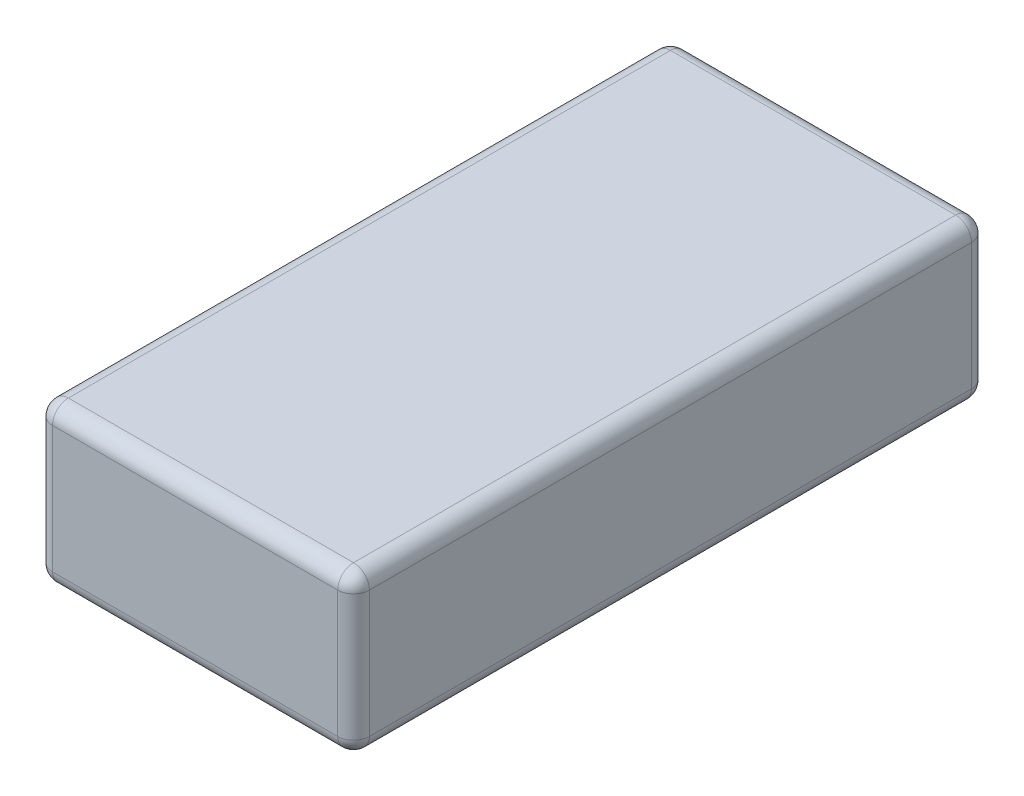
ISO-10303-21;
HEADER;
FILE_DESCRIPTION(('STEP AP214'),'2;1');
FILE_NAME('part.step','',(''),(''),'','','');
FILE_SCHEMA(('AUTOMOTIVE_DESIGN { 1 0 10303 214 1 1 1 1 }'));
ENDSEC;
DATA;
#1=APPLICATION_CONTEXT('core data for automotive mechanical design processes');
#2=APPLICATION_PROTOCOL_DEFINITION('international standard','automotive_design',2000,#1);
#3=PRODUCT_CONTEXT('',#1,'mechanical');
#4=PRODUCT('Part','Part','',(#3));
#5=PRODUCT_RELATED_PRODUCT_CATEGORY('part','',(#4));
#6=PRODUCT_DEFINITION_FORMATION('','',#4);
#7=PRODUCT_DEFINITION_CONTEXT('part definition',#1,'design');
#8=PRODUCT_DEFINITION('design','',#6,#7);
#9=PRODUCT_DEFINITION_SHAPE('','',#8);
#10=(LENGTH_UNIT() NAMED_UNIT(*) SI_UNIT(.MILLI.,.METRE.));
#11=(NAMED_UNIT(*) PLANE_ANGLE_UNIT() SI_UNIT($,.RADIAN.));
#12=(NAMED_UNIT(*) SI_UNIT($,.STERADIAN.) SOLID_ANGLE_UNIT());
#13=UNCERTAINTY_MEASURE_WITH_UNIT(LENGTH_MEASURE(1.E-05),#10,'distance_accuracy_value','');
#14=(GEOMETRIC_REPRESENTATION_CONTEXT(3) GLOBAL_UNCERTAINTY_ASSIGNED_CONTEXT((#13)) GLOBAL_UNIT_ASSIGNED_CONTEXT((#10,
#11,#12)) REPRESENTATION_CONTEXT('',''));
#15=CARTESIAN_POINT('',(0.,0.,0.));
#16=DIRECTION('',(0.,0.,1.));
#17=DIRECTION('',(1.,0.,0.));
#18=AXIS2_PLACEMENT_3D('',#15,#16,#17);
#19=CARTESIAN_POINT('',(-5.,5.,10.));
#20=DIRECTION('',(1.,0.,0.));
#21=DIRECTION('',(0.,0.,-1.));
#22=AXIS2_PLACEMENT_3D('',#19,#20,#21);
#23=PLANE('',#22);
#24=DIRECTION('',(0.,-1.,0.));
#25=VECTOR('',#24,1.);
#26=CARTESIAN_POINT('',(-5.,5.,-9.5));
#27=LINE('',#26,#25);
#28=CARTESIAN_POINT('',(-5.,4.5,-9.5));
#29=VERTEX_POINT('',#28);
#30=CARTESIAN_POINT('',(-5.,0.5,-9.5));
#31=VERTEX_POINT('',#30);
#32=EDGE_CURVE('E135',#29,#31,#27,.T.);
#33=ORIENTED_EDGE('',*,*,#32,.T.);
#34=DIRECTION('',(0.,0.,1.));
#35=VECTOR('',#34,1.);
#36=CARTESIAN_POINT('',(-5.,0.5,10.));
#37=LINE('',#36,#35);
#38=CARTESIAN_POINT('',(-5.,0.5,9.5));
#39=VERTEX_POINT('',#38);
#40=EDGE_CURVE('E131',#31,#39,#37,.T.);
#41=ORIENTED_EDGE('',*,*,#40,.T.);
#42=DIRECTION('',(0.,-1.,0.));
#43=VECTOR('',#42,1.);
#44=CARTESIAN_POINT('',(-5.,5.,9.5));
#45=LINE('',#44,#43);
#46=CARTESIAN_POINT('',(-5.,4.5,9.5));
#47=VERTEX_POINT('',#46);
#48=EDGE_CURVE('E124',#39,#47,#45,.F.);
#49=ORIENTED_EDGE('',*,*,#48,.T.);
#50=DIRECTION('',(0.,0.,1.));
#51=VECTOR('',#50,1.);
#52=CARTESIAN_POINT('',(-5.,4.5,-10.));
#53=LINE('',#52,#51);
#54=EDGE_CURVE('E128',#47,#29,#53,.F.);
#55=ORIENTED_EDGE('',*,*,#54,.T.);
#56=EDGE_LOOP('',(#33,#41,#49,#55));
#57=FACE_BOUND('',#56,.T.);
#58=ADVANCED_FACE('F36',(#57),#23,.F.);
#59=CARTESIAN_POINT('',(5.,5.,10.));
#60=DIRECTION('',(0.,0.,-1.));
#61=DIRECTION('',(-1.,0.,0.));
#62=AXIS2_PLACEMENT_3D('',#59,#60,#61);
#63=PLANE('',#62);
#64=DIRECTION('',(0.,-1.,0.));
#65=VECTOR('',#64,1.);
#66=CARTESIAN_POINT('',(-4.5,5.,10.));
#67=LINE('',#66,#65);
#68=CARTESIAN_POINT('',(-4.5,4.5,10.));
#69=VERTEX_POINT('',#68);
#70=CARTESIAN_POINT('',(-4.5,0.5,10.));
#71=VERTEX_POINT('',#70);
#72=EDGE_CURVE('E143',#69,#71,#67,.T.);
#73=ORIENTED_EDGE('',*,*,#72,.T.);
#74=DIRECTION('',(1.,0.,0.));
#75=VECTOR('',#74,1.);
#76=CARTESIAN_POINT('',(5.,0.5,10.));
#77=LINE('',#76,#75);
#78=CARTESIAN_POINT('',(4.5,0.5,10.));
#79=VERTEX_POINT('',#78);
#80=EDGE_CURVE('E181',#71,#79,#77,.T.);
#81=ORIENTED_EDGE('',*,*,#80,.T.);
#82=DIRECTION('',(0.,-1.,0.));
#83=VECTOR('',#82,1.);
#84=CARTESIAN_POINT('',(4.5,5.,10.));
#85=LINE('',#84,#83);
#86=CARTESIAN_POINT('',(4.5,4.5,10.));
#87=VERTEX_POINT('',#86);
#88=EDGE_CURVE('E178',#79,#87,#85,.F.);
#89=ORIENTED_EDGE('',*,*,#88,.T.);
#90=DIRECTION('',(1.,0.,0.));
#91=VECTOR('',#90,1.);
#92=CARTESIAN_POINT('',(-5.,4.5,10.));
#93=LINE('',#92,#91);
#94=EDGE_CURVE('E176',#87,#69,#93,.F.);
#95=ORIENTED_EDGE('',*,*,#94,.T.);
#96=EDGE_LOOP('',(#73,#81,#89,#95));
#97=FACE_BOUND('',#96,.T.);
#98=ADVANCED_FACE('F298',(#97),#63,.F.);
#99=CARTESIAN_POINT('',(5.,5.,10.));
#100=DIRECTION('',(-1.,0.,0.));
#101=DIRECTION('',(0.,0.,1.));
#102=AXIS2_PLACEMENT_3D('',#99,#100,#101);
#103=PLANE('',#102);
#104=DIRECTION('',(0.,-1.,0.));
#105=VECTOR('',#104,1.);
#106=CARTESIAN_POINT('',(5.,5.,9.5));
#107=LINE('',#106,#105);
#108=CARTESIAN_POINT('',(5.,4.5,9.5));
#109=VERTEX_POINT('',#108);
#110=CARTESIAN_POINT('',(5.,0.5,9.5));
#111=VERTEX_POINT('',#110);
#112=EDGE_CURVE('E187',#109,#111,#107,.T.);
#113=ORIENTED_EDGE('',*,*,#112,.T.);
#114=DIRECTION('',(0.,0.,-1.));
#115=VECTOR('',#114,1.);
#116=CARTESIAN_POINT('',(5.,0.5,10.));
#117=LINE('',#116,#115);
#118=CARTESIAN_POINT('',(5.,0.5,-9.5));
#119=VERTEX_POINT('',#118);
#120=EDGE_CURVE('E190',#111,#119,#117,.T.);
#121=ORIENTED_EDGE('',*,*,#120,.T.);
#122=DIRECTION('',(0.,-1.,0.));
#123=VECTOR('',#122,1.);
#124=CARTESIAN_POINT('',(5.,5.,-9.5));
#125=LINE('',#124,#123);
#126=CARTESIAN_POINT('',(5.,4.5,-9.5));
#127=VERTEX_POINT('',#126);
#128=EDGE_CURVE('E185',#119,#127,#125,.F.);
#129=ORIENTED_EDGE('',*,*,#128,.T.);
#130=DIRECTION('',(0.,0.,-1.));
#131=VECTOR('',#130,1.);
#132=CARTESIAN_POINT('',(5.,4.5,10.));
#133=LINE('',#132,#131);
#134=EDGE_CURVE('E183',#127,#109,#133,.F.);
#135=ORIENTED_EDGE('',*,*,#134,.T.);
#136=EDGE_LOOP('',(#113,#121,#129,#135));
#137=FACE_BOUND('',#136,.T.);
#138=ADVANCED_FACE('F275',(#137),#103,.F.);
#139=CARTESIAN_POINT('',(5.,5.,-10.));
#140=DIRECTION('',(0.,0.,1.));
#141=DIRECTION('',(1.,0.,0.));
#142=AXIS2_PLACEMENT_3D('',#139,#140,#141);
#143=PLANE('',#142);
#144=DIRECTION('',(0.,-1.,0.));
#145=VECTOR('',#144,1.);
#146=CARTESIAN_POINT('',(4.5,5.,-10.));
#147=LINE('',#146,#145);
#148=CARTESIAN_POINT('',(4.5,4.5,-10.));
#149=VERTEX_POINT('',#148);
#150=CARTESIAN_POINT('',(4.5,0.5,-10.));
#151=VERTEX_POINT('',#150);
#152=EDGE_CURVE('E169',#149,#151,#147,.T.);
#153=ORIENTED_EDGE('',*,*,#152,.T.);
#154=DIRECTION('',(-1.,0.,0.));
#155=VECTOR('',#154,1.);
#156=CARTESIAN_POINT('',(5.,0.5,-10.));
#157=LINE('',#156,#155);
#158=CARTESIAN_POINT('',(-4.5,0.5,-10.));
#159=VERTEX_POINT('',#158);
#160=EDGE_CURVE('E174',#151,#159,#157,.T.);
#161=ORIENTED_EDGE('',*,*,#160,.T.);
#162=DIRECTION('',(0.,-1.,0.));
#163=VECTOR('',#162,1.);
#164=CARTESIAN_POINT('',(-4.5,5.,-10.));
#165=LINE('',#164,#163);
#166=CARTESIAN_POINT('',(-4.5,4.5,-10.));
#167=VERTEX_POINT('',#166);
#168=EDGE_CURVE('E171',#159,#167,#165,.F.);
#169=ORIENTED_EDGE('',*,*,#168,.T.);
#170=DIRECTION('',(-1.,0.,0.));
#171=VECTOR('',#170,1.);
#172=CARTESIAN_POINT('',(5.,4.5,-10.));
#173=LINE('',#172,#171);
#174=EDGE_CURVE('E167',#167,#149,#173,.F.);
#175=ORIENTED_EDGE('',*,*,#174,.T.);
#176=EDGE_LOOP('',(#153,#161,#169,#175));
#177=FACE_BOUND('',#176,.T.);
#178=ADVANCED_FACE('F305',(#177),#143,.F.);
#179=CARTESIAN_POINT('',(0.,5.,0.));
#180=DIRECTION('',(0.,1.,0.));
#181=DIRECTION('',(0.,0.,1.));
#182=AXIS2_PLACEMENT_3D('',#179,#180,#181);
#183=PLANE('',#182);
#184=DIRECTION('',(0.,0.,-1.));
#185=VECTOR('',#184,1.);
#186=CARTESIAN_POINT('',(4.5,5.,-10.));
#187=LINE('',#186,#185);
#188=CARTESIAN_POINT('',(4.5,5.,9.5));
#189=VERTEX_POINT('',#188);
#190=CARTESIAN_POINT('',(4.5,5.,-9.5));
#191=VERTEX_POINT('',#190);
#192=EDGE_CURVE('E45',#189,#191,#187,.T.);
#193=ORIENTED_EDGE('',*,*,#192,.T.);
#194=DIRECTION('',(-1.,0.,0.));
#195=VECTOR('',#194,1.);
#196=CARTESIAN_POINT('',(-5.,5.,-9.5));
#197=LINE('',#196,#195);
#198=CARTESIAN_POINT('',(-4.5,5.,-9.5));
#199=VERTEX_POINT('',#198);
#200=EDGE_CURVE('E11',#191,#199,#197,.T.);
#201=ORIENTED_EDGE('',*,*,#200,.T.);
#202=DIRECTION('',(0.,0.,1.));
#203=VECTOR('',#202,1.);
#204=CARTESIAN_POINT('',(-4.5,5.,10.));
#205=LINE('',#204,#203);
#206=CARTESIAN_POINT('',(-4.5,5.,9.5));
#207=VERTEX_POINT('',#206);
#208=EDGE_CURVE('E201',#199,#207,#205,.T.);
#209=ORIENTED_EDGE('',*,*,#208,.T.);
#210=DIRECTION('',(1.,0.,0.));
#211=VECTOR('',#210,1.);
#212=CARTESIAN_POINT('',(5.,5.,9.5));
#213=LINE('',#212,#211);
#214=EDGE_CURVE('E56',#207,#189,#213,.T.);
#215=ORIENTED_EDGE('',*,*,#214,.T.);
#216=EDGE_LOOP('',(#193,#201,#209,#215));
#217=FACE_BOUND('',#216,.T.);
#218=ADVANCED_FACE('F368',(#217),#183,.T.);
#219=CARTESIAN_POINT('',(0.,0.,0.));
#220=DIRECTION('',(0.,1.,0.));
#221=DIRECTION('',(0.,0.,1.));
#222=AXIS2_PLACEMENT_3D('',#219,#220,#221);
#223=PLANE('',#222);
#224=DIRECTION('',(0.,0.,-1.));
#225=VECTOR('',#224,1.);
#226=CARTESIAN_POINT('',(4.5,0.,0.));
#227=LINE('',#226,#225);
#228=CARTESIAN_POINT('',(4.5,0.,-9.5));
#229=VERTEX_POINT('',#228);
#230=CARTESIAN_POINT('',(4.5,0.,9.5));
#231=VERTEX_POINT('',#230);
#232=EDGE_CURVE('E196',#229,#231,#227,.F.);
#233=ORIENTED_EDGE('',*,*,#232,.T.);
#234=DIRECTION('',(1.,0.,0.));
#235=VECTOR('',#234,1.);
#236=CARTESIAN_POINT('',(0.,0.,9.5));
#237=LINE('',#236,#235);
#238=CARTESIAN_POINT('',(-4.5,0.,9.5));
#239=VERTEX_POINT('',#238);
#240=EDGE_CURVE('E198',#231,#239,#237,.F.);
#241=ORIENTED_EDGE('',*,*,#240,.T.);
#242=DIRECTION('',(0.,0.,1.));
#243=VECTOR('',#242,1.);
#244=CARTESIAN_POINT('',(-4.5,0.,0.));
#245=LINE('',#244,#243);
#246=CARTESIAN_POINT('',(-4.5,0.,-9.5));
#247=VERTEX_POINT('',#246);
#248=EDGE_CURVE('E192',#239,#247,#245,.F.);
#249=ORIENTED_EDGE('',*,*,#248,.T.);
#250=DIRECTION('',(-1.,0.,0.));
#251=VECTOR('',#250,1.);
#252=CARTESIAN_POINT('',(0.,0.,-9.5));
#253=LINE('',#252,#251);
#254=EDGE_CURVE('E194',#247,#229,#253,.F.);
#255=ORIENTED_EDGE('',*,*,#254,.T.);
#256=EDGE_LOOP('',(#233,#241,#249,#255));
#257=FACE_BOUND('',#256,.T.);
#258=ADVANCED_FACE('F267',(#257),#223,.F.);
#259=CARTESIAN_POINT('',(4.5,5.,9.5));
#260=DIRECTION('',(0.,-1.,0.));
#261=DIRECTION('',(0.,0.,-1.));
#262=AXIS2_PLACEMENT_3D('',#259,#260,#261);
#263=CYLINDRICAL_SURFACE('',#262,0.5);
#264=CARTESIAN_POINT('',(4.5,4.5,9.5));
#265=DIRECTION('',(0.,1.,0.));
#266=DIRECTION('',(0.,0.,1.));
#267=AXIS2_PLACEMENT_3D('',#264,#265,#266);
#268=CIRCLE('',#267,0.5);
#269=EDGE_CURVE('E40',#87,#109,#268,.T.);
#270=ORIENTED_EDGE('',*,*,#269,.F.);
#271=ORIENTED_EDGE('',*,*,#88,.F.);
#272=CARTESIAN_POINT('',(4.5,0.5,9.5));
#273=DIRECTION('',(0.,-1.,0.));
#274=DIRECTION('',(0.,0.,-1.));
#275=AXIS2_PLACEMENT_3D('',#272,#273,#274);
#276=CIRCLE('',#275,0.5);
#277=EDGE_CURVE('E163',#111,#79,#276,.T.);
#278=ORIENTED_EDGE('',*,*,#277,.F.);
#279=ORIENTED_EDGE('',*,*,#112,.F.);
#280=EDGE_LOOP('',(#270,#271,#278,#279));
#281=FACE_BOUND('',#280,.T.);
#282=ADVANCED_FACE('F38',(#281),#263,.T.);
#283=CARTESIAN_POINT('',(4.5,4.5,9.5));
#284=DIRECTION('',(0.,0.,1.));
#285=DIRECTION('',(1.,0.,0.));
#286=AXIS2_PLACEMENT_3D('',#283,#284,#285);
#287=SPHERICAL_SURFACE('',#286,0.5);
#288=CARTESIAN_POINT('',(4.5,4.5,9.5));
#289=DIRECTION('',(1.,0.,0.));
#290=DIRECTION('',(0.,0.,-1.));
#291=AXIS2_PLACEMENT_3D('',#288,#289,#290);
#292=CIRCLE('',#291,0.5);
#293=EDGE_CURVE('E248',#87,#189,#292,.F.);
#294=ORIENTED_EDGE('',*,*,#293,.F.);
#295=ORIENTED_EDGE('',*,*,#269,.T.);
#296=CARTESIAN_POINT('',(4.5,4.5,9.5));
#297=DIRECTION('',(0.,0.,1.));
#298=DIRECTION('',(1.,0.,0.));
#299=AXIS2_PLACEMENT_3D('',#296,#297,#298);
#300=CIRCLE('',#299,0.5);
#301=EDGE_CURVE('E250',#189,#109,#300,.F.);
#302=ORIENTED_EDGE('',*,*,#301,.F.);
#303=EDGE_LOOP('',(#294,#295,#302));
#304=FACE_BOUND('',#303,.T.);
#305=ADVANCED_FACE('F293',(#304),#287,.T.);
#306=CARTESIAN_POINT('',(4.5,0.5,9.5));
#307=DIRECTION('',(0.,0.,1.));
#308=DIRECTION('',(1.,0.,0.));
#309=AXIS2_PLACEMENT_3D('',#306,#307,#308);
#310=SPHERICAL_SURFACE('',#309,0.5);
#311=CARTESIAN_POINT('',(4.5,0.5,9.5));
#312=DIRECTION('',(0.,0.,1.));
#313=DIRECTION('',(1.,0.,0.));
#314=AXIS2_PLACEMENT_3D('',#311,#312,#313);
#315=CIRCLE('',#314,0.5);
#316=EDGE_CURVE('E242',#111,#231,#315,.F.);
#317=ORIENTED_EDGE('',*,*,#316,.F.);
#318=ORIENTED_EDGE('',*,*,#277,.T.);
#319=CARTESIAN_POINT('',(4.5,0.5,9.5));
#320=DIRECTION('',(1.,0.,0.));
#321=DIRECTION('',(0.,0.,-1.));
#322=AXIS2_PLACEMENT_3D('',#319,#320,#321);
#323=CIRCLE('',#322,0.5);
#324=EDGE_CURVE('E245',#231,#79,#323,.F.);
#325=ORIENTED_EDGE('',*,*,#324,.F.);
#326=EDGE_LOOP('',(#317,#318,#325));
#327=FACE_BOUND('',#326,.T.);
#328=ADVANCED_FACE('F257',(#327),#310,.T.);
#329=CARTESIAN_POINT('',(4.5,4.5,0.));
#330=DIRECTION('',(0.,0.,1.));
#331=DIRECTION('',(1.,0.,0.));
#332=AXIS2_PLACEMENT_3D('',#329,#330,#331);
#333=CYLINDRICAL_SURFACE('',#332,0.5);
#334=ORIENTED_EDGE('',*,*,#301,.T.);
#335=ORIENTED_EDGE('',*,*,#134,.F.);
#336=CARTESIAN_POINT('',(4.5,4.5,-9.5));
#337=DIRECTION('',(0.,0.,-1.));
#338=DIRECTION('',(-1.,0.,0.));
#339=AXIS2_PLACEMENT_3D('',#336,#337,#338);
#340=CIRCLE('',#339,0.5);
#341=EDGE_CURVE('E236',#191,#127,#340,.T.);
#342=ORIENTED_EDGE('',*,*,#341,.F.);
#343=ORIENTED_EDGE('',*,*,#192,.F.);
#344=EDGE_LOOP('',(#334,#335,#342,#343));
#345=FACE_BOUND('',#344,.T.);
#346=ADVANCED_FACE('F288',(#345),#333,.T.);
#347=CARTESIAN_POINT('',(0.,4.5,9.5));
#348=DIRECTION('',(-1.,0.,0.));
#349=DIRECTION('',(0.,0.,1.));
#350=AXIS2_PLACEMENT_3D('',#347,#348,#349);
#351=CYLINDRICAL_SURFACE('',#350,0.5);
#352=ORIENTED_EDGE('',*,*,#293,.T.);
#353=ORIENTED_EDGE('',*,*,#214,.F.);
#354=CARTESIAN_POINT('',(-4.5,4.5,9.5));
#355=DIRECTION('',(-1.,0.,0.));
#356=DIRECTION('',(0.,-1.,0.));
#357=AXIS2_PLACEMENT_3D('',#354,#355,#356);
#358=CIRCLE('',#357,0.5);
#359=EDGE_CURVE('E147',#69,#207,#358,.T.);
#360=ORIENTED_EDGE('',*,*,#359,.F.);
#361=ORIENTED_EDGE('',*,*,#94,.F.);
#362=EDGE_LOOP('',(#352,#353,#360,#361));
#363=FACE_BOUND('',#362,.T.);
#364=ADVANCED_FACE('F296',(#363),#351,.T.);
#365=CARTESIAN_POINT('',(-4.5,5.,9.5));
#366=DIRECTION('',(0.,-1.,0.));
#367=DIRECTION('',(0.,0.,-1.));
#368=AXIS2_PLACEMENT_3D('',#365,#366,#367);
#369=CYLINDRICAL_SURFACE('',#368,0.5);
#370=CARTESIAN_POINT('',(-4.5,0.5,9.5));
#371=DIRECTION('',(0.,-1.,0.));
#372=DIRECTION('',(0.,0.,-1.));
#373=AXIS2_PLACEMENT_3D('',#370,#371,#372);
#374=CIRCLE('',#373,0.5);
#375=EDGE_CURVE('E148',#71,#39,#374,.T.);
#376=ORIENTED_EDGE('',*,*,#375,.F.);
#377=ORIENTED_EDGE('',*,*,#72,.F.);
#378=CARTESIAN_POINT('',(-4.5,4.5,9.5));
#379=DIRECTION('',(0.,1.,0.));
#380=DIRECTION('',(0.,0.,1.));
#381=AXIS2_PLACEMENT_3D('',#378,#379,#380);
#382=CIRCLE('',#381,0.5);
#383=EDGE_CURVE('E139',#47,#69,#382,.T.);
#384=ORIENTED_EDGE('',*,*,#383,.F.);
#385=ORIENTED_EDGE('',*,*,#48,.F.);
#386=EDGE_LOOP('',(#376,#377,#384,#385));
#387=FACE_BOUND('',#386,.T.);
#388=ADVANCED_FACE('F141',(#387),#369,.T.);
#389=CARTESIAN_POINT('',(5.,0.5,9.5));
#390=DIRECTION('',(1.,0.,0.));
#391=DIRECTION('',(0.,0.,-1.));
#392=AXIS2_PLACEMENT_3D('',#389,#390,#391);
#393=CYLINDRICAL_SURFACE('',#392,0.5);
#394=ORIENTED_EDGE('',*,*,#324,.T.);
#395=ORIENTED_EDGE('',*,*,#80,.F.);
#396=CARTESIAN_POINT('',(-4.5,0.5,9.5));
#397=DIRECTION('',(-1.,0.,0.));
#398=DIRECTION('',(0.,0.,1.));
#399=AXIS2_PLACEMENT_3D('',#396,#397,#398);
#400=CIRCLE('',#399,0.5);
#401=EDGE_CURVE('E232',#239,#71,#400,.T.);
#402=ORIENTED_EDGE('',*,*,#401,.F.);
#403=ORIENTED_EDGE('',*,*,#240,.F.);
#404=EDGE_LOOP('',(#394,#395,#402,#403));
#405=FACE_BOUND('',#404,.T.);
#406=ADVANCED_FACE('F264',(#405),#393,.T.);
#407=CARTESIAN_POINT('',(4.5,0.5,10.));
#408=DIRECTION('',(0.,0.,-1.));
#409=DIRECTION('',(-1.,0.,0.));
#410=AXIS2_PLACEMENT_3D('',#407,#408,#409);
#411=CYLINDRICAL_SURFACE('',#410,0.5);
#412=ORIENTED_EDGE('',*,*,#316,.T.);
#413=ORIENTED_EDGE('',*,*,#232,.F.);
#414=CARTESIAN_POINT('',(4.5,0.5,-9.5));
#415=DIRECTION('',(0.,0.,-1.));
#416=DIRECTION('',(-1.,0.,0.));
#417=AXIS2_PLACEMENT_3D('',#414,#415,#416);
#418=CIRCLE('',#417,0.5);
#419=EDGE_CURVE('E229',#119,#229,#418,.T.);
#420=ORIENTED_EDGE('',*,*,#419,.F.);
#421=ORIENTED_EDGE('',*,*,#120,.F.);
#422=EDGE_LOOP('',(#412,#413,#420,#421));
#423=FACE_BOUND('',#422,.T.);
#424=ADVANCED_FACE('F272',(#423),#411,.T.);
#425=CARTESIAN_POINT('',(4.5,5.,-9.5));
#426=DIRECTION('',(0.,-1.,0.));
#427=DIRECTION('',(0.,0.,-1.));
#428=AXIS2_PLACEMENT_3D('',#425,#426,#427);
#429=CYLINDRICAL_SURFACE('',#428,0.5);
#430=CARTESIAN_POINT('',(4.5,4.5,-9.5));
#431=DIRECTION('',(0.,1.,0.));
#432=DIRECTION('',(0.,0.,1.));
#433=AXIS2_PLACEMENT_3D('',#430,#431,#432);
#434=CIRCLE('',#433,0.5);
#435=EDGE_CURVE('E239',#127,#149,#434,.T.);
#436=ORIENTED_EDGE('',*,*,#435,.F.);
#437=ORIENTED_EDGE('',*,*,#128,.F.);
#438=CARTESIAN_POINT('',(4.5,0.5,-9.5));
#439=DIRECTION('',(0.,-1.,0.));
#440=DIRECTION('',(0.,0.,-1.));
#441=AXIS2_PLACEMENT_3D('',#438,#439,#440);
#442=CIRCLE('',#441,0.5);
#443=EDGE_CURVE('E226',#151,#119,#442,.T.);
#444=ORIENTED_EDGE('',*,*,#443,.F.);
#445=ORIENTED_EDGE('',*,*,#152,.F.);
#446=EDGE_LOOP('',(#436,#437,#444,#445));
#447=FACE_BOUND('',#446,.T.);
#448=ADVANCED_FACE('F280',(#447),#429,.T.);
#449=CARTESIAN_POINT('',(4.5,4.5,-9.5));
#450=DIRECTION('',(0.,0.,1.));
#451=DIRECTION('',(1.,0.,0.));
#452=AXIS2_PLACEMENT_3D('',#449,#450,#451);
#453=SPHERICAL_SURFACE('',#452,0.5);
#454=ORIENTED_EDGE('',*,*,#341,.T.);
#455=ORIENTED_EDGE('',*,*,#435,.T.);
#456=CARTESIAN_POINT('',(4.5,4.5,-9.5));
#457=DIRECTION('',(1.,0.,0.));
#458=DIRECTION('',(0.,0.,-1.));
#459=AXIS2_PLACEMENT_3D('',#456,#457,#458);
#460=CIRCLE('',#459,0.5);
#461=EDGE_CURVE('E155',#191,#149,#460,.F.);
#462=ORIENTED_EDGE('',*,*,#461,.F.);
#463=EDGE_LOOP('',(#454,#455,#462));
#464=FACE_BOUND('',#463,.T.);
#465=ADVANCED_FACE('F285',(#464),#453,.T.);
#466=CARTESIAN_POINT('',(-4.5,4.5,9.5));
#467=DIRECTION('',(0.,0.,1.));
#468=DIRECTION('',(1.,0.,0.));
#469=AXIS2_PLACEMENT_3D('',#466,#467,#468);
#470=SPHERICAL_SURFACE('',#469,0.5);
#471=ORIENTED_EDGE('',*,*,#383,.T.);
#472=ORIENTED_EDGE('',*,*,#359,.T.);
#473=CARTESIAN_POINT('',(-4.5,4.5,9.5));
#474=DIRECTION('',(0.,0.,1.));
#475=DIRECTION('',(1.,0.,0.));
#476=AXIS2_PLACEMENT_3D('',#473,#474,#475);
#477=CIRCLE('',#476,0.5);
#478=EDGE_CURVE('E151',#47,#207,#477,.F.);
#479=ORIENTED_EDGE('',*,*,#478,.F.);
#480=EDGE_LOOP('',(#471,#472,#479));
#481=FACE_BOUND('',#480,.T.);
#482=ADVANCED_FACE('F152',(#481),#470,.T.);
#483=CARTESIAN_POINT('',(-4.5,0.5,9.5));
#484=DIRECTION('',(0.,0.,1.));
#485=DIRECTION('',(1.,0.,0.));
#486=AXIS2_PLACEMENT_3D('',#483,#484,#485);
#487=SPHERICAL_SURFACE('',#486,0.5);
#488=ORIENTED_EDGE('',*,*,#401,.T.);
#489=ORIENTED_EDGE('',*,*,#375,.T.);
#490=CARTESIAN_POINT('',(-4.5,0.5,9.5));
#491=DIRECTION('',(0.,0.,1.));
#492=DIRECTION('',(1.,0.,0.));
#493=AXIS2_PLACEMENT_3D('',#490,#491,#492);
#494=CIRCLE('',#493,0.5);
#495=EDGE_CURVE('E156',#239,#39,#494,.F.);
#496=ORIENTED_EDGE('',*,*,#495,.F.);
#497=EDGE_LOOP('',(#488,#489,#496));
#498=FACE_BOUND('',#497,.T.);
#499=ADVANCED_FACE('F339',(#498),#487,.T.);
#500=CARTESIAN_POINT('',(4.5,0.5,-9.5));
#501=DIRECTION('',(0.,0.,1.));
#502=DIRECTION('',(1.,0.,0.));
#503=AXIS2_PLACEMENT_3D('',#500,#501,#502);
#504=SPHERICAL_SURFACE('',#503,0.5);
#505=ORIENTED_EDGE('',*,*,#443,.T.);
#506=ORIENTED_EDGE('',*,*,#419,.T.);
#507=CARTESIAN_POINT('',(4.5,0.5,-9.5));
#508=DIRECTION('',(1.,0.,0.));
#509=DIRECTION('',(0.,0.,-1.));
#510=AXIS2_PLACEMENT_3D('',#507,#508,#509);
#511=CIRCLE('',#510,0.5);
#512=EDGE_CURVE('E219',#151,#229,#511,.F.);
#513=ORIENTED_EDGE('',*,*,#512,.F.);
#514=EDGE_LOOP('',(#505,#506,#513));
#515=FACE_BOUND('',#514,.T.);
#516=ADVANCED_FACE('F335',(#515),#504,.T.);
#517=CARTESIAN_POINT('',(0.,4.5,-9.5));
#518=DIRECTION('',(1.,0.,0.));
#519=DIRECTION('',(0.,0.,-1.));
#520=AXIS2_PLACEMENT_3D('',#517,#518,#519);
#521=CYLINDRICAL_SURFACE('',#520,0.5);
#522=ORIENTED_EDGE('',*,*,#461,.T.);
#523=ORIENTED_EDGE('',*,*,#174,.F.);
#524=CARTESIAN_POINT('',(-4.5,4.5,-9.5));
#525=DIRECTION('',(-1.,0.,0.));
#526=DIRECTION('',(0.,0.,1.));
#527=AXIS2_PLACEMENT_3D('',#524,#525,#526);
#528=CIRCLE('',#527,0.5);
#529=EDGE_CURVE('E216',#199,#167,#528,.T.);
#530=ORIENTED_EDGE('',*,*,#529,.F.);
#531=ORIENTED_EDGE('',*,*,#200,.F.);
#532=EDGE_LOOP('',(#522,#523,#530,#531));
#533=FACE_BOUND('',#532,.T.);
#534=ADVANCED_FACE('F332',(#533),#521,.T.);
#535=CARTESIAN_POINT('',(-4.5,4.5,0.));
#536=DIRECTION('',(0.,0.,-1.));
#537=DIRECTION('',(-1.,0.,0.));
#538=AXIS2_PLACEMENT_3D('',#535,#536,#537);
#539=CYLINDRICAL_SURFACE('',#538,0.5);
#540=ORIENTED_EDGE('',*,*,#478,.T.);
#541=ORIENTED_EDGE('',*,*,#208,.F.);
#542=CARTESIAN_POINT('',(-4.5,4.5,-9.5));
#543=DIRECTION('',(0.,0.,-1.));
#544=DIRECTION('',(-1.,0.,0.));
#545=AXIS2_PLACEMENT_3D('',#542,#543,#544);
#546=CIRCLE('',#545,0.5);
#547=EDGE_CURVE('E159',#29,#199,#546,.T.);
#548=ORIENTED_EDGE('',*,*,#547,.F.);
#549=ORIENTED_EDGE('',*,*,#54,.F.);
#550=EDGE_LOOP('',(#540,#541,#548,#549));
#551=FACE_BOUND('',#550,.T.);
#552=ADVANCED_FACE('F158',(#551),#539,.T.);
#553=CARTESIAN_POINT('',(-4.5,0.5,10.));
#554=DIRECTION('',(0.,0.,1.));
#555=DIRECTION('',(1.,0.,0.));
#556=AXIS2_PLACEMENT_3D('',#553,#554,#555);
#557=CYLINDRICAL_SURFACE('',#556,0.5);
#558=ORIENTED_EDGE('',*,*,#495,.T.);
#559=ORIENTED_EDGE('',*,*,#40,.F.);
#560=CARTESIAN_POINT('',(-4.5,0.5,-9.5));
#561=DIRECTION('',(0.,0.,-1.));
#562=DIRECTION('',(-1.,0.,0.));
#563=AXIS2_PLACEMENT_3D('',#560,#561,#562);
#564=CIRCLE('',#563,0.5);
#565=EDGE_CURVE('E212',#247,#31,#564,.T.);
#566=ORIENTED_EDGE('',*,*,#565,.F.);
#567=ORIENTED_EDGE('',*,*,#248,.F.);
#568=EDGE_LOOP('',(#558,#559,#566,#567));
#569=FACE_BOUND('',#568,.T.);
#570=ADVANCED_FACE('F325',(#569),#557,.T.);
#571=CARTESIAN_POINT('',(5.,0.5,-9.5));
#572=DIRECTION('',(-1.,0.,0.));
#573=DIRECTION('',(0.,0.,1.));
#574=AXIS2_PLACEMENT_3D('',#571,#572,#573);
#575=CYLINDRICAL_SURFACE('',#574,0.5);
#576=ORIENTED_EDGE('',*,*,#512,.T.);
#577=ORIENTED_EDGE('',*,*,#254,.F.);
#578=CARTESIAN_POINT('',(-4.5,0.5,-9.5));
#579=DIRECTION('',(-1.,0.,0.));
#580=DIRECTION('',(0.,0.,1.));
#581=AXIS2_PLACEMENT_3D('',#578,#579,#580);
#582=CIRCLE('',#581,0.5);
#583=EDGE_CURVE('E209',#159,#247,#582,.T.);
#584=ORIENTED_EDGE('',*,*,#583,.F.);
#585=ORIENTED_EDGE('',*,*,#160,.F.);
#586=EDGE_LOOP('',(#576,#577,#584,#585));
#587=FACE_BOUND('',#586,.T.);
#588=ADVANCED_FACE('F321',(#587),#575,.T.);
#589=CARTESIAN_POINT('',(-4.5,4.5,-9.5));
#590=DIRECTION('',(0.,0.,1.));
#591=DIRECTION('',(1.,0.,0.));
#592=AXIS2_PLACEMENT_3D('',#589,#590,#591);
#593=SPHERICAL_SURFACE('',#592,0.5);
#594=ORIENTED_EDGE('',*,*,#547,.T.);
#595=ORIENTED_EDGE('',*,*,#529,.T.);
#596=CARTESIAN_POINT('',(-4.5,4.5,-9.5));
#597=DIRECTION('',(0.,1.,0.));
#598=DIRECTION('',(0.,0.,1.));
#599=AXIS2_PLACEMENT_3D('',#596,#597,#598);
#600=CIRCLE('',#599,0.5);
#601=EDGE_CURVE('E207',#29,#167,#600,.F.);
#602=ORIENTED_EDGE('',*,*,#601,.F.);
#603=EDGE_LOOP('',(#594,#595,#602));
#604=FACE_BOUND('',#603,.T.);
#605=ADVANCED_FACE('F317',(#604),#593,.T.);
#606=CARTESIAN_POINT('',(-4.5,0.5,-9.5));
#607=DIRECTION('',(0.,0.,1.));
#608=DIRECTION('',(1.,0.,0.));
#609=AXIS2_PLACEMENT_3D('',#606,#607,#608);
#610=SPHERICAL_SURFACE('',#609,0.5);
#611=ORIENTED_EDGE('',*,*,#583,.T.);
#612=ORIENTED_EDGE('',*,*,#565,.T.);
#613=CARTESIAN_POINT('',(-4.5,0.5,-9.5));
#614=DIRECTION('',(0.,-1.,0.));
#615=DIRECTION('',(0.,0.,-1.));
#616=AXIS2_PLACEMENT_3D('',#613,#614,#615);
#617=CIRCLE('',#616,0.5);
#618=EDGE_CURVE('E205',#159,#31,#617,.F.);
#619=ORIENTED_EDGE('',*,*,#618,.F.);
#620=EDGE_LOOP('',(#611,#612,#619));
#621=FACE_BOUND('',#620,.T.);
#622=ADVANCED_FACE('F313',(#621),#610,.T.);
#623=CARTESIAN_POINT('',(-4.5,5.,-9.5));
#624=DIRECTION('',(0.,-1.,0.));
#625=DIRECTION('',(0.,0.,-1.));
#626=AXIS2_PLACEMENT_3D('',#623,#624,#625);
#627=CYLINDRICAL_SURFACE('',#626,0.5);
#628=ORIENTED_EDGE('',*,*,#601,.T.);
#629=ORIENTED_EDGE('',*,*,#168,.F.);
#630=ORIENTED_EDGE('',*,*,#618,.T.);
#631=ORIENTED_EDGE('',*,*,#32,.F.);
#632=EDGE_LOOP('',(#628,#629,#630,#631));
#633=FACE_BOUND('',#632,.T.);
#634=ADVANCED_FACE('F310',(#633),#627,.T.);
#635=CLOSED_SHELL('',(#58,#98,#138,#178,#218,#258,#282,#305,#328,#346,#364,#388,#406,#424,#448,
#465,#482,#499,#516,#534,#552,#570,#588,#605,#622,#634));
#636=MANIFOLD_SOLID_BREP('B2',#635);
#637=ADVANCED_BREP_SHAPE_REPRESENTATION('',(#18,#636),#14);
#638=SHAPE_DEFINITION_REPRESENTATION(#9,#637);
ENDSEC;
END-ISO-10303-21;
